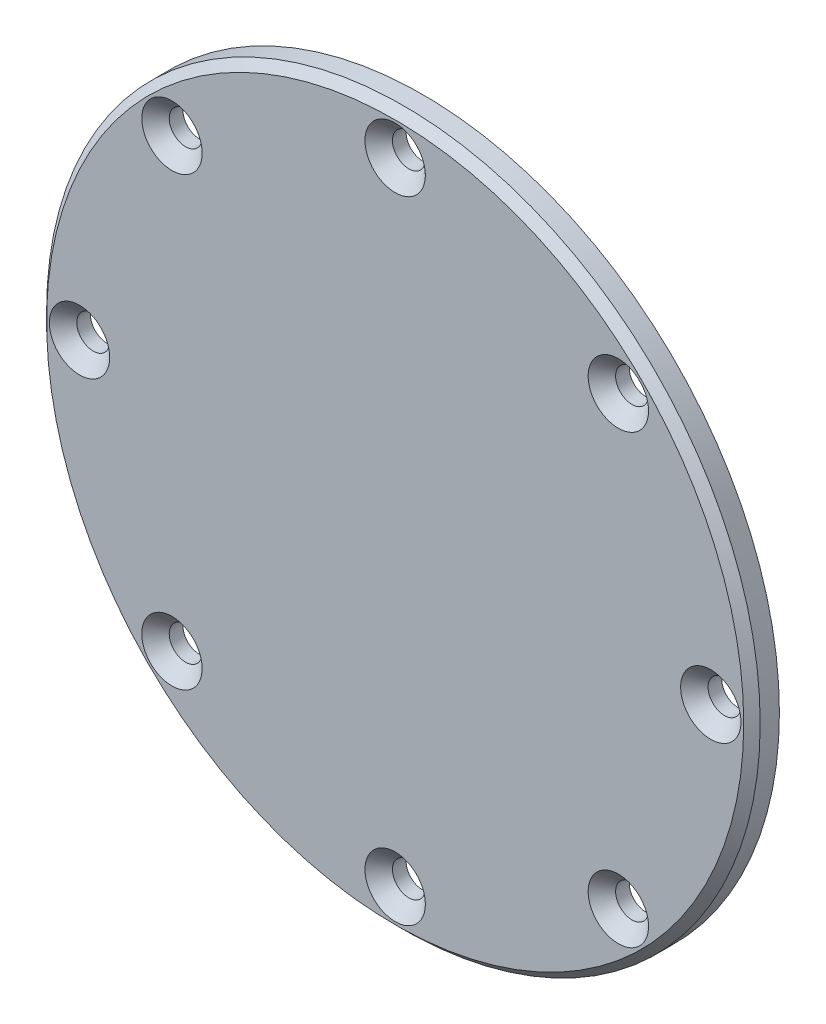
ISO-10303-21;
HEADER;
FILE_DESCRIPTION(('STEP AP214'),'2;1');
FILE_NAME('part.step','',(''),(''),'','','');
FILE_SCHEMA(('AUTOMOTIVE_DESIGN { 1 0 10303 214 1 1 1 1 }'));
ENDSEC;
DATA;
#1=APPLICATION_CONTEXT('core data for automotive mechanical design processes');
#2=APPLICATION_PROTOCOL_DEFINITION('international standard','automotive_design',2000,#1);
#3=PRODUCT_CONTEXT('',#1,'mechanical');
#4=PRODUCT('Part','Part','',(#3));
#5=PRODUCT_RELATED_PRODUCT_CATEGORY('part','',(#4));
#6=PRODUCT_DEFINITION_FORMATION('','',#4);
#7=PRODUCT_DEFINITION_CONTEXT('part definition',#1,'design');
#8=PRODUCT_DEFINITION('design','',#6,#7);
#9=PRODUCT_DEFINITION_SHAPE('','',#8);
#10=(LENGTH_UNIT() NAMED_UNIT(*) SI_UNIT(.MILLI.,.METRE.));
#11=(NAMED_UNIT(*) PLANE_ANGLE_UNIT() SI_UNIT($,.RADIAN.));
#12=(NAMED_UNIT(*) SI_UNIT($,.STERADIAN.) SOLID_ANGLE_UNIT());
#13=UNCERTAINTY_MEASURE_WITH_UNIT(LENGTH_MEASURE(1.E-05),#10,'distance_accuracy_value','');
#14=(GEOMETRIC_REPRESENTATION_CONTEXT(3) GLOBAL_UNCERTAINTY_ASSIGNED_CONTEXT((#13)) GLOBAL_UNIT_ASSIGNED_CONTEXT((#10,
#11,#12)) REPRESENTATION_CONTEXT('',''));
#15=CARTESIAN_POINT('',(0.,0.,0.));
#16=DIRECTION('',(0.,0.,1.));
#17=DIRECTION('',(1.,0.,0.));
#18=AXIS2_PLACEMENT_3D('',#15,#16,#17);
#19=CARTESIAN_POINT('',(0.,0.,2.));
#20=DIRECTION('',(0.,0.,-1.));
#21=DIRECTION('',(-1.,0.,0.));
#22=AXIS2_PLACEMENT_3D('',#19,#20,#21);
#23=CYLINDRICAL_SURFACE('',#22,26.);
#24=CARTESIAN_POINT('',(0.,0.,1.40000000000001));
#25=DIRECTION('',(0.,0.,1.));
#26=DIRECTION('',(1.,0.,0.));
#27=AXIS2_PLACEMENT_3D('',#24,#25,#26);
#28=CIRCLE('',#27,26.);
#29=CARTESIAN_POINT('',(26.,0.,1.40000000000001));
#30=VERTEX_POINT('',#29);
#31=EDGE_CURVE('E10',#30,#30,#28,.F.);
#32=ORIENTED_EDGE('',*,*,#31,.T.);
#33=EDGE_LOOP('',(#32));
#34=FACE_BOUND('',#33,.T.);
#35=CARTESIAN_POINT('',(0.,0.,0.));
#36=DIRECTION('',(0.,0.,1.));
#37=DIRECTION('',(1.,0.,0.));
#38=AXIS2_PLACEMENT_3D('',#35,#36,#37);
#39=CIRCLE('',#38,26.);
#40=CARTESIAN_POINT('',(26.,0.,0.));
#41=VERTEX_POINT('',#40);
#42=EDGE_CURVE('E44',#41,#41,#39,.T.);
#43=ORIENTED_EDGE('',*,*,#42,.T.);
#44=EDGE_LOOP('',(#43));
#45=FACE_BOUND('',#44,.T.);
#46=ADVANCED_FACE('F32',(#34,#45),#23,.T.);
#47=CARTESIAN_POINT('',(0.,0.,2.));
#48=DIRECTION('',(0.,0.,1.));
#49=DIRECTION('',(1.,0.,0.));
#50=AXIS2_PLACEMENT_3D('',#47,#48,#49);
#51=PLANE('',#50);
#52=CARTESIAN_POINT('',(0.,-23.,2.));
#53=DIRECTION('',(0.,0.,1.));
#54=DIRECTION('',(0.,1.,0.));
#55=AXIS2_PLACEMENT_3D('',#52,#53,#54);
#56=CIRCLE('',#55,2.2);
#57=CARTESIAN_POINT('',(0.,-20.8,2.));
#58=VERTEX_POINT('',#57);
#59=EDGE_CURVE('E88',#58,#58,#56,.T.);
#60=ORIENTED_EDGE('',*,*,#59,.F.);
#61=EDGE_LOOP('',(#60));
#62=FACE_BOUND('',#61,.T.);
#63=CARTESIAN_POINT('',(16.2634559672907,-16.2634559672905,2.));
#64=DIRECTION('',(0.,0.,1.));
#65=DIRECTION('',(-0.707106781186551,0.707106781186544,0.));
#66=AXIS2_PLACEMENT_3D('',#63,#64,#65);
#67=CIRCLE('',#66,2.2);
#68=CARTESIAN_POINT('',(14.7078210486803,-14.7078210486801,2.));
#69=VERTEX_POINT('',#68);
#70=EDGE_CURVE('E79',#69,#69,#67,.T.);
#71=ORIENTED_EDGE('',*,*,#70,.F.);
#72=EDGE_LOOP('',(#71));
#73=FACE_BOUND('',#72,.T.);
#74=CARTESIAN_POINT('',(23.,0.,2.));
#75=DIRECTION('',(0.,0.,1.));
#76=DIRECTION('',(-1.,0.,0.));
#77=AXIS2_PLACEMENT_3D('',#74,#75,#76);
#78=CIRCLE('',#77,2.2);
#79=CARTESIAN_POINT('',(20.8,0.,2.));
#80=VERTEX_POINT('',#79);
#81=EDGE_CURVE('E68',#80,#80,#78,.T.);
#82=ORIENTED_EDGE('',*,*,#81,.F.);
#83=EDGE_LOOP('',(#82));
#84=FACE_BOUND('',#83,.T.);
#85=CARTESIAN_POINT('',(16.2634559672905,16.2634559672907,2.));
#86=DIRECTION('',(0.,0.,1.));
#87=DIRECTION('',(-0.707106781186541,-0.707106781186554,0.));
#88=AXIS2_PLACEMENT_3D('',#85,#86,#87);
#89=CIRCLE('',#88,2.2);
#90=CARTESIAN_POINT('',(14.7078210486801,14.7078210486803,2.));
#91=VERTEX_POINT('',#90);
#92=EDGE_CURVE('E72',#91,#91,#89,.T.);
#93=ORIENTED_EDGE('',*,*,#92,.F.);
#94=EDGE_LOOP('',(#93));
#95=FACE_BOUND('',#94,.T.);
#96=CARTESIAN_POINT('',(-2.40912212380176E-13,23.,2.));
#97=DIRECTION('',(0.,0.,1.));
#98=DIRECTION('',(0.,-1.,0.));
#99=AXIS2_PLACEMENT_3D('',#96,#97,#98);
#100=CIRCLE('',#99,2.2);
#101=CARTESIAN_POINT('',(-2.17868435543812E-13,20.8,2.));
#102=VERTEX_POINT('',#101);
#103=EDGE_CURVE('E104',#102,#102,#100,.T.);
#104=ORIENTED_EDGE('',*,*,#103,.F.);
#105=EDGE_LOOP('',(#104));
#106=FACE_BOUND('',#105,.T.);
#107=CARTESIAN_POINT('',(-16.2634559672908,16.2634559672904,2.));
#108=DIRECTION('',(0.,0.,1.));
#109=DIRECTION('',(0.707106781186556,-0.707106781186539,0.));
#110=AXIS2_PLACEMENT_3D('',#107,#108,#109);
#111=CIRCLE('',#110,2.2);
#112=CARTESIAN_POINT('',(-14.7078210486804,14.70782104868,2.));
#113=VERTEX_POINT('',#112);
#114=EDGE_CURVE('E108',#113,#113,#111,.T.);
#115=ORIENTED_EDGE('',*,*,#114,.F.);
#116=EDGE_LOOP('',(#115));
#117=FACE_BOUND('',#116,.T.);
#118=CARTESIAN_POINT('',(-16.2634559672906,-16.2634559672906,2.));
#119=DIRECTION('',(0.,0.,1.));
#120=DIRECTION('',(0.707106781186546,0.707106781186549,0.));
#121=AXIS2_PLACEMENT_3D('',#118,#119,#120);
#122=CIRCLE('',#121,2.2);
#123=CARTESIAN_POINT('',(-14.7078210486802,-14.7078210486802,2.));
#124=VERTEX_POINT('',#123);
#125=EDGE_CURVE('E61',#124,#124,#122,.T.);
#126=ORIENTED_EDGE('',*,*,#125,.F.);
#127=EDGE_LOOP('',(#126));
#128=FACE_BOUND('',#127,.T.);
#129=CARTESIAN_POINT('',(-23.,0.,2.));
#130=DIRECTION('',(0.,0.,1.));
#131=DIRECTION('',(1.,0.,0.));
#132=AXIS2_PLACEMENT_3D('',#129,#130,#131);
#133=CIRCLE('',#132,2.2);
#134=CARTESIAN_POINT('',(-20.8,0.,2.));
#135=VERTEX_POINT('',#134);
#136=EDGE_CURVE('E52',#135,#135,#133,.T.);
#137=ORIENTED_EDGE('',*,*,#136,.F.);
#138=EDGE_LOOP('',(#137));
#139=FACE_BOUND('',#138,.T.);
#140=CARTESIAN_POINT('',(0.,0.,2.));
#141=DIRECTION('',(0.,0.,1.));
#142=DIRECTION('',(1.,0.,0.));
#143=AXIS2_PLACEMENT_3D('',#140,#141,#142);
#144=CIRCLE('',#143,25.4);
#145=CARTESIAN_POINT('',(25.4,0.,2.));
#146=VERTEX_POINT('',#145);
#147=EDGE_CURVE('E40',#146,#146,#144,.T.);
#148=ORIENTED_EDGE('',*,*,#147,.T.);
#149=EDGE_LOOP('',(#148));
#150=FACE_BOUND('',#149,.T.);
#151=ADVANCED_FACE('F121',(#62,#73,#84,#95,#106,#117,#128,#139,#150),#51,.T.);
#152=CARTESIAN_POINT('',(0.,0.,0.));
#153=DIRECTION('',(0.,0.,1.));
#154=DIRECTION('',(1.,0.,0.));
#155=AXIS2_PLACEMENT_3D('',#152,#153,#154);
#156=PLANE('',#155);
#157=CARTESIAN_POINT('',(0.,-23.,0.));
#158=DIRECTION('',(0.,0.,1.));
#159=DIRECTION('',(0.,1.,0.));
#160=AXIS2_PLACEMENT_3D('',#157,#158,#159);
#161=CIRCLE('',#160,1.2);
#162=CARTESIAN_POINT('',(0.,-21.8,0.));
#163=VERTEX_POINT('',#162);
#164=EDGE_CURVE('E96',#163,#163,#161,.T.);
#165=ORIENTED_EDGE('',*,*,#164,.T.);
#166=EDGE_LOOP('',(#165));
#167=FACE_BOUND('',#166,.T.);
#168=CARTESIAN_POINT('',(16.2634559672907,-16.2634559672905,0.));
#169=DIRECTION('',(0.,0.,1.));
#170=DIRECTION('',(-0.707106781186551,0.707106781186544,0.));
#171=AXIS2_PLACEMENT_3D('',#168,#169,#170);
#172=CIRCLE('',#171,1.2);
#173=CARTESIAN_POINT('',(15.4149278298668,-15.4149278298667,0.));
#174=VERTEX_POINT('',#173);
#175=EDGE_CURVE('E89',#174,#174,#172,.T.);
#176=ORIENTED_EDGE('',*,*,#175,.T.);
#177=EDGE_LOOP('',(#176));
#178=FACE_BOUND('',#177,.T.);
#179=CARTESIAN_POINT('',(23.,0.,0.));
#180=DIRECTION('',(0.,0.,1.));
#181=DIRECTION('',(-1.,0.,0.));
#182=AXIS2_PLACEMENT_3D('',#179,#180,#181);
#183=CIRCLE('',#182,1.2);
#184=CARTESIAN_POINT('',(21.8,0.,0.));
#185=VERTEX_POINT('',#184);
#186=EDGE_CURVE('E80',#185,#185,#183,.T.);
#187=ORIENTED_EDGE('',*,*,#186,.T.);
#188=EDGE_LOOP('',(#187));
#189=FACE_BOUND('',#188,.T.);
#190=CARTESIAN_POINT('',(16.2634559672905,16.2634559672907,0.));
#191=DIRECTION('',(0.,0.,1.));
#192=DIRECTION('',(-0.707106781186541,-0.707106781186554,0.));
#193=AXIS2_PLACEMENT_3D('',#190,#191,#192);
#194=CIRCLE('',#193,1.2);
#195=CARTESIAN_POINT('',(15.4149278298666,15.4149278298669,0.));
#196=VERTEX_POINT('',#195);
#197=EDGE_CURVE('E69',#196,#196,#194,.T.);
#198=ORIENTED_EDGE('',*,*,#197,.T.);
#199=EDGE_LOOP('',(#198));
#200=FACE_BOUND('',#199,.T.);
#201=CARTESIAN_POINT('',(-2.40912212380176E-13,23.,0.));
#202=DIRECTION('',(0.,0.,1.));
#203=DIRECTION('',(0.,-1.,0.));
#204=AXIS2_PLACEMENT_3D('',#201,#202,#203);
#205=CIRCLE('',#204,1.2);
#206=CARTESIAN_POINT('',(-2.28342879560341E-13,21.8,0.));
#207=VERTEX_POINT('',#206);
#208=EDGE_CURVE('E113',#207,#207,#205,.T.);
#209=ORIENTED_EDGE('',*,*,#208,.T.);
#210=EDGE_LOOP('',(#209));
#211=FACE_BOUND('',#210,.T.);
#212=CARTESIAN_POINT('',(-16.2634559672908,16.2634559672904,0.));
#213=DIRECTION('',(0.,0.,1.));
#214=DIRECTION('',(0.707106781186556,-0.707106781186539,0.));
#215=AXIS2_PLACEMENT_3D('',#212,#213,#214);
#216=CIRCLE('',#215,1.2);
#217=CARTESIAN_POINT('',(-15.4149278298669,15.4149278298665,0.));
#218=VERTEX_POINT('',#217);
#219=EDGE_CURVE('E105',#218,#218,#216,.T.);
#220=ORIENTED_EDGE('',*,*,#219,.T.);
#221=EDGE_LOOP('',(#220));
#222=FACE_BOUND('',#221,.T.);
#223=CARTESIAN_POINT('',(-16.2634559672906,-16.2634559672906,0.));
#224=DIRECTION('',(0.,0.,1.));
#225=DIRECTION('',(0.707106781186546,0.707106781186549,0.));
#226=AXIS2_PLACEMENT_3D('',#223,#224,#225);
#227=CIRCLE('',#226,1.2);
#228=CARTESIAN_POINT('',(-15.4149278298667,-15.4149278298668,0.));
#229=VERTEX_POINT('',#228);
#230=EDGE_CURVE('E58',#229,#229,#227,.T.);
#231=ORIENTED_EDGE('',*,*,#230,.T.);
#232=EDGE_LOOP('',(#231));
#233=FACE_BOUND('',#232,.T.);
#234=CARTESIAN_POINT('',(-23.,0.,0.));
#235=DIRECTION('',(0.,0.,1.));
#236=DIRECTION('',(1.,0.,0.));
#237=AXIS2_PLACEMENT_3D('',#234,#235,#236);
#238=CIRCLE('',#237,1.2);
#239=CARTESIAN_POINT('',(-21.8,0.,0.));
#240=VERTEX_POINT('',#239);
#241=EDGE_CURVE('E36',#240,#240,#238,.T.);
#242=ORIENTED_EDGE('',*,*,#241,.T.);
#243=EDGE_LOOP('',(#242));
#244=FACE_BOUND('',#243,.T.);
#245=ORIENTED_EDGE('',*,*,#42,.F.);
#246=EDGE_LOOP('',(#245));
#247=FACE_BOUND('',#246,.T.);
#248=ADVANCED_FACE('F124',(#167,#178,#189,#200,#211,#222,#233,#244,#247),#156,.F.);
#249=CARTESIAN_POINT('',(0.,0.,2.));
#250=DIRECTION('',(0.,0.,-1.));
#251=DIRECTION('',(-1.,0.,0.));
#252=AXIS2_PLACEMENT_3D('',#249,#250,#251);
#253=CONICAL_SURFACE('',#252,25.4,0.785398163397445);
#254=ORIENTED_EDGE('',*,*,#31,.F.);
#255=EDGE_LOOP('',(#254));
#256=FACE_BOUND('',#255,.T.);
#257=ORIENTED_EDGE('',*,*,#147,.F.);
#258=EDGE_LOOP('',(#257));
#259=FACE_BOUND('',#258,.T.);
#260=ADVANCED_FACE('F34',(#256,#259),#253,.T.);
#261=CARTESIAN_POINT('',(-23.,0.,2.));
#262=DIRECTION('',(0.,0.,1.));
#263=DIRECTION('',(1.,0.,0.));
#264=AXIS2_PLACEMENT_3D('',#261,#262,#263);
#265=CYLINDRICAL_SURFACE('',#264,1.2);
#266=CARTESIAN_POINT('',(-23.,0.,0.999999999999994));
#267=DIRECTION('',(0.,0.,1.));
#268=DIRECTION('',(1.,0.,0.));
#269=AXIS2_PLACEMENT_3D('',#266,#267,#268);
#270=CIRCLE('',#269,1.2);
#271=CARTESIAN_POINT('',(-21.8,0.,0.999999999999994));
#272=VERTEX_POINT('',#271);
#273=EDGE_CURVE('E49',#272,#272,#270,.T.);
#274=ORIENTED_EDGE('',*,*,#273,.T.);
#275=EDGE_LOOP('',(#274));
#276=FACE_BOUND('',#275,.T.);
#277=ORIENTED_EDGE('',*,*,#241,.F.);
#278=EDGE_LOOP('',(#277));
#279=FACE_BOUND('',#278,.T.);
#280=ADVANCED_FACE('F136',(#276,#279),#265,.F.);
#281=CARTESIAN_POINT('',(-23.,0.,2.));
#282=DIRECTION('',(0.,0.,1.));
#283=DIRECTION('',(1.,0.,0.));
#284=AXIS2_PLACEMENT_3D('',#281,#282,#283);
#285=CONICAL_SURFACE('',#284,2.2,0.785398163397447);
#286=ORIENTED_EDGE('',*,*,#273,.F.);
#287=EDGE_LOOP('',(#286));
#288=FACE_BOUND('',#287,.T.);
#289=ORIENTED_EDGE('',*,*,#136,.T.);
#290=EDGE_LOOP('',(#289));
#291=FACE_BOUND('',#290,.T.);
#292=ADVANCED_FACE('F142',(#288,#291),#285,.F.);
#293=CARTESIAN_POINT('',(-16.2634559672906,-16.2634559672906,2.));
#294=DIRECTION('',(0.,0.,1.));
#295=DIRECTION('',(0.707106781186546,0.707106781186549,0.));
#296=AXIS2_PLACEMENT_3D('',#293,#294,#295);
#297=CYLINDRICAL_SURFACE('',#296,1.2);
#298=CARTESIAN_POINT('',(-16.2634559672906,-16.2634559672906,0.999999999999994));
#299=DIRECTION('',(0.,0.,1.));
#300=DIRECTION('',(0.707106781186546,0.707106781186549,0.));
#301=AXIS2_PLACEMENT_3D('',#298,#299,#300);
#302=CIRCLE('',#301,1.2);
#303=CARTESIAN_POINT('',(-15.4149278298667,-15.4149278298668,0.999999999999994));
#304=VERTEX_POINT('',#303);
#305=EDGE_CURVE('E55',#304,#304,#302,.T.);
#306=ORIENTED_EDGE('',*,*,#305,.T.);
#307=EDGE_LOOP('',(#306));
#308=FACE_BOUND('',#307,.T.);
#309=ORIENTED_EDGE('',*,*,#230,.F.);
#310=EDGE_LOOP('',(#309));
#311=FACE_BOUND('',#310,.T.);
#312=ADVANCED_FACE('F154',(#308,#311),#297,.F.);
#313=CARTESIAN_POINT('',(-16.2634559672906,-16.2634559672906,2.));
#314=DIRECTION('',(0.,0.,1.));
#315=DIRECTION('',(0.707106781186546,0.707106781186549,0.));
#316=AXIS2_PLACEMENT_3D('',#313,#314,#315);
#317=CONICAL_SURFACE('',#316,2.2,0.785398163397447);
#318=ORIENTED_EDGE('',*,*,#305,.F.);
#319=EDGE_LOOP('',(#318));
#320=FACE_BOUND('',#319,.T.);
#321=ORIENTED_EDGE('',*,*,#125,.T.);
#322=EDGE_LOOP('',(#321));
#323=FACE_BOUND('',#322,.T.);
#324=ADVANCED_FACE('F158',(#320,#323),#317,.F.);
#325=CARTESIAN_POINT('',(-16.2634559672908,16.2634559672904,2.));
#326=DIRECTION('',(0.,0.,1.));
#327=DIRECTION('',(0.707106781186556,-0.707106781186539,0.));
#328=AXIS2_PLACEMENT_3D('',#325,#326,#327);
#329=CYLINDRICAL_SURFACE('',#328,1.2);
#330=CARTESIAN_POINT('',(-16.2634559672908,16.2634559672904,0.999999999999994));
#331=DIRECTION('',(0.,0.,1.));
#332=DIRECTION('',(0.707106781186556,-0.707106781186539,0.));
#333=AXIS2_PLACEMENT_3D('',#330,#331,#332);
#334=CIRCLE('',#333,1.2);
#335=CARTESIAN_POINT('',(-15.4149278298669,15.4149278298665,0.999999999999994));
#336=VERTEX_POINT('',#335);
#337=EDGE_CURVE('E101',#336,#336,#334,.T.);
#338=ORIENTED_EDGE('',*,*,#337,.T.);
#339=EDGE_LOOP('',(#338));
#340=FACE_BOUND('',#339,.T.);
#341=ORIENTED_EDGE('',*,*,#219,.F.);
#342=EDGE_LOOP('',(#341));
#343=FACE_BOUND('',#342,.T.);
#344=ADVANCED_FACE('F162',(#340,#343),#329,.F.);
#345=CARTESIAN_POINT('',(-16.2634559672908,16.2634559672904,2.));
#346=DIRECTION('',(0.,0.,1.));
#347=DIRECTION('',(0.707106781186556,-0.707106781186539,0.));
#348=AXIS2_PLACEMENT_3D('',#345,#346,#347);
#349=CONICAL_SURFACE('',#348,2.2,0.785398163397447);
#350=ORIENTED_EDGE('',*,*,#337,.F.);
#351=EDGE_LOOP('',(#350));
#352=FACE_BOUND('',#351,.T.);
#353=ORIENTED_EDGE('',*,*,#114,.T.);
#354=EDGE_LOOP('',(#353));
#355=FACE_BOUND('',#354,.T.);
#356=ADVANCED_FACE('F198',(#352,#355),#349,.F.);
#357=CARTESIAN_POINT('',(-2.40912212380176E-13,23.,2.));
#358=DIRECTION('',(0.,0.,1.));
#359=DIRECTION('',(0.,-1.,0.));
#360=AXIS2_PLACEMENT_3D('',#357,#358,#359);
#361=CYLINDRICAL_SURFACE('',#360,1.2);
#362=CARTESIAN_POINT('',(-2.40912212380176E-13,23.,0.999999999999994));
#363=DIRECTION('',(0.,0.,1.));
#364=DIRECTION('',(0.,-1.,0.));
#365=AXIS2_PLACEMENT_3D('',#362,#363,#364);
#366=CIRCLE('',#365,1.2);
#367=CARTESIAN_POINT('',(-2.28342879560341E-13,21.8,0.999999999999994));
#368=VERTEX_POINT('',#367);
#369=EDGE_CURVE('E75',#368,#368,#366,.T.);
#370=ORIENTED_EDGE('',*,*,#369,.T.);
#371=EDGE_LOOP('',(#370));
#372=FACE_BOUND('',#371,.T.);
#373=ORIENTED_EDGE('',*,*,#208,.F.);
#374=EDGE_LOOP('',(#373));
#375=FACE_BOUND('',#374,.T.);
#376=ADVANCED_FACE('F202',(#372,#375),#361,.F.);
#377=CARTESIAN_POINT('',(-2.40912212380176E-13,23.,2.));
#378=DIRECTION('',(0.,0.,1.));
#379=DIRECTION('',(0.,-1.,0.));
#380=AXIS2_PLACEMENT_3D('',#377,#378,#379);
#381=CONICAL_SURFACE('',#380,2.2,0.785398163397447);
#382=ORIENTED_EDGE('',*,*,#369,.F.);
#383=EDGE_LOOP('',(#382));
#384=FACE_BOUND('',#383,.T.);
#385=ORIENTED_EDGE('',*,*,#103,.T.);
#386=EDGE_LOOP('',(#385));
#387=FACE_BOUND('',#386,.T.);
#388=ADVANCED_FACE('F119',(#384,#387),#381,.F.);
#389=CARTESIAN_POINT('',(16.2634559672905,16.2634559672907,2.));
#390=DIRECTION('',(0.,0.,1.));
#391=DIRECTION('',(-0.707106781186541,-0.707106781186554,0.));
#392=AXIS2_PLACEMENT_3D('',#389,#390,#391);
#393=CYLINDRICAL_SURFACE('',#392,1.2);
#394=CARTESIAN_POINT('',(16.2634559672905,16.2634559672907,0.999999999999994));
#395=DIRECTION('',(0.,0.,1.));
#396=DIRECTION('',(-0.707106781186541,-0.707106781186554,0.));
#397=AXIS2_PLACEMENT_3D('',#394,#395,#396);
#398=CIRCLE('',#397,1.2);
#399=CARTESIAN_POINT('',(15.4149278298666,15.4149278298669,0.999999999999994));
#400=VERTEX_POINT('',#399);
#401=EDGE_CURVE('E65',#400,#400,#398,.T.);
#402=ORIENTED_EDGE('',*,*,#401,.T.);
#403=EDGE_LOOP('',(#402));
#404=FACE_BOUND('',#403,.T.);
#405=ORIENTED_EDGE('',*,*,#197,.F.);
#406=EDGE_LOOP('',(#405));
#407=FACE_BOUND('',#406,.T.);
#408=ADVANCED_FACE('F164',(#404,#407),#393,.F.);
#409=CARTESIAN_POINT('',(16.2634559672905,16.2634559672907,2.));
#410=DIRECTION('',(0.,0.,1.));
#411=DIRECTION('',(-0.707106781186541,-0.707106781186554,0.));
#412=AXIS2_PLACEMENT_3D('',#409,#410,#411);
#413=CONICAL_SURFACE('',#412,2.2,0.785398163397447);
#414=ORIENTED_EDGE('',*,*,#401,.F.);
#415=EDGE_LOOP('',(#414));
#416=FACE_BOUND('',#415,.T.);
#417=ORIENTED_EDGE('',*,*,#92,.T.);
#418=EDGE_LOOP('',(#417));
#419=FACE_BOUND('',#418,.T.);
#420=ADVANCED_FACE('F167',(#416,#419),#413,.F.);
#421=CARTESIAN_POINT('',(23.,0.,2.));
#422=DIRECTION('',(0.,0.,1.));
#423=DIRECTION('',(-1.,0.,0.));
#424=AXIS2_PLACEMENT_3D('',#421,#422,#423);
#425=CYLINDRICAL_SURFACE('',#424,1.2);
#426=CARTESIAN_POINT('',(23.,0.,0.999999999999994));
#427=DIRECTION('',(0.,0.,1.));
#428=DIRECTION('',(-1.,0.,0.));
#429=AXIS2_PLACEMENT_3D('',#426,#427,#428);
#430=CIRCLE('',#429,1.2);
#431=CARTESIAN_POINT('',(21.8,0.,0.999999999999994));
#432=VERTEX_POINT('',#431);
#433=EDGE_CURVE('E76',#432,#432,#430,.T.);
#434=ORIENTED_EDGE('',*,*,#433,.T.);
#435=EDGE_LOOP('',(#434));
#436=FACE_BOUND('',#435,.T.);
#437=ORIENTED_EDGE('',*,*,#186,.F.);
#438=EDGE_LOOP('',(#437));
#439=FACE_BOUND('',#438,.T.);
#440=ADVANCED_FACE('F171',(#436,#439),#425,.F.);
#441=CARTESIAN_POINT('',(23.,0.,2.));
#442=DIRECTION('',(0.,0.,1.));
#443=DIRECTION('',(-1.,0.,0.));
#444=AXIS2_PLACEMENT_3D('',#441,#442,#443);
#445=CONICAL_SURFACE('',#444,2.2,0.785398163397447);
#446=ORIENTED_EDGE('',*,*,#433,.F.);
#447=EDGE_LOOP('',(#446));
#448=FACE_BOUND('',#447,.T.);
#449=ORIENTED_EDGE('',*,*,#81,.T.);
#450=EDGE_LOOP('',(#449));
#451=FACE_BOUND('',#450,.T.);
#452=ADVANCED_FACE('F175',(#448,#451),#445,.F.);
#453=CARTESIAN_POINT('',(16.2634559672907,-16.2634559672905,2.));
#454=DIRECTION('',(0.,0.,1.));
#455=DIRECTION('',(-0.707106781186551,0.707106781186544,0.));
#456=AXIS2_PLACEMENT_3D('',#453,#454,#455);
#457=CYLINDRICAL_SURFACE('',#456,1.2);
#458=CARTESIAN_POINT('',(16.2634559672907,-16.2634559672905,0.999999999999994));
#459=DIRECTION('',(0.,0.,1.));
#460=DIRECTION('',(-0.707106781186551,0.707106781186544,0.));
#461=AXIS2_PLACEMENT_3D('',#458,#459,#460);
#462=CIRCLE('',#461,1.2);
#463=CARTESIAN_POINT('',(15.4149278298668,-15.4149278298667,0.999999999999994));
#464=VERTEX_POINT('',#463);
#465=EDGE_CURVE('E85',#464,#464,#462,.T.);
#466=ORIENTED_EDGE('',*,*,#465,.T.);
#467=EDGE_LOOP('',(#466));
#468=FACE_BOUND('',#467,.T.);
#469=ORIENTED_EDGE('',*,*,#175,.F.);
#470=EDGE_LOOP('',(#469));
#471=FACE_BOUND('',#470,.T.);
#472=ADVANCED_FACE('F179',(#468,#471),#457,.F.);
#473=CARTESIAN_POINT('',(16.2634559672907,-16.2634559672905,2.));
#474=DIRECTION('',(0.,0.,1.));
#475=DIRECTION('',(-0.707106781186551,0.707106781186544,0.));
#476=AXIS2_PLACEMENT_3D('',#473,#474,#475);
#477=CONICAL_SURFACE('',#476,2.2,0.785398163397447);
#478=ORIENTED_EDGE('',*,*,#465,.F.);
#479=EDGE_LOOP('',(#478));
#480=FACE_BOUND('',#479,.T.);
#481=ORIENTED_EDGE('',*,*,#70,.T.);
#482=EDGE_LOOP('',(#481));
#483=FACE_BOUND('',#482,.T.);
#484=ADVANCED_FACE('F183',(#480,#483),#477,.F.);
#485=CARTESIAN_POINT('',(0.,-23.,2.));
#486=DIRECTION('',(0.,0.,1.));
#487=DIRECTION('',(0.,1.,0.));
#488=AXIS2_PLACEMENT_3D('',#485,#486,#487);
#489=CYLINDRICAL_SURFACE('',#488,1.2);
#490=CARTESIAN_POINT('',(0.,-23.,0.999999999999994));
#491=DIRECTION('',(0.,0.,1.));
#492=DIRECTION('',(0.,1.,0.));
#493=AXIS2_PLACEMENT_3D('',#490,#491,#492);
#494=CIRCLE('',#493,1.2);
#495=CARTESIAN_POINT('',(0.,-21.8,0.999999999999994));
#496=VERTEX_POINT('',#495);
#497=EDGE_CURVE('E64',#496,#496,#494,.T.);
#498=ORIENTED_EDGE('',*,*,#497,.T.);
#499=EDGE_LOOP('',(#498));
#500=FACE_BOUND('',#499,.T.);
#501=ORIENTED_EDGE('',*,*,#164,.F.);
#502=EDGE_LOOP('',(#501));
#503=FACE_BOUND('',#502,.T.);
#504=ADVANCED_FACE('F187',(#500,#503),#489,.F.);
#505=CARTESIAN_POINT('',(0.,-23.,2.));
#506=DIRECTION('',(0.,0.,1.));
#507=DIRECTION('',(0.,1.,0.));
#508=AXIS2_PLACEMENT_3D('',#505,#506,#507);
#509=CONICAL_SURFACE('',#508,2.2,0.785398163397447);
#510=ORIENTED_EDGE('',*,*,#497,.F.);
#511=EDGE_LOOP('',(#510));
#512=FACE_BOUND('',#511,.T.);
#513=ORIENTED_EDGE('',*,*,#59,.T.);
#514=EDGE_LOOP('',(#513));
#515=FACE_BOUND('',#514,.T.);
#516=ADVANCED_FACE('F191',(#512,#515),#509,.F.);
#517=CLOSED_SHELL('',(#46,#151,#248,#260,#280,#292,#312,#324,#344,#356,#376,#388,#408,#420,#440,
#452,#472,#484,#504,#516));
#518=MANIFOLD_SOLID_BREP('B2',#517);
#519=ADVANCED_BREP_SHAPE_REPRESENTATION('',(#18,#518),#14);
#520=SHAPE_DEFINITION_REPRESENTATION(#9,#519);
ENDSEC;
END-ISO-10303-21;
